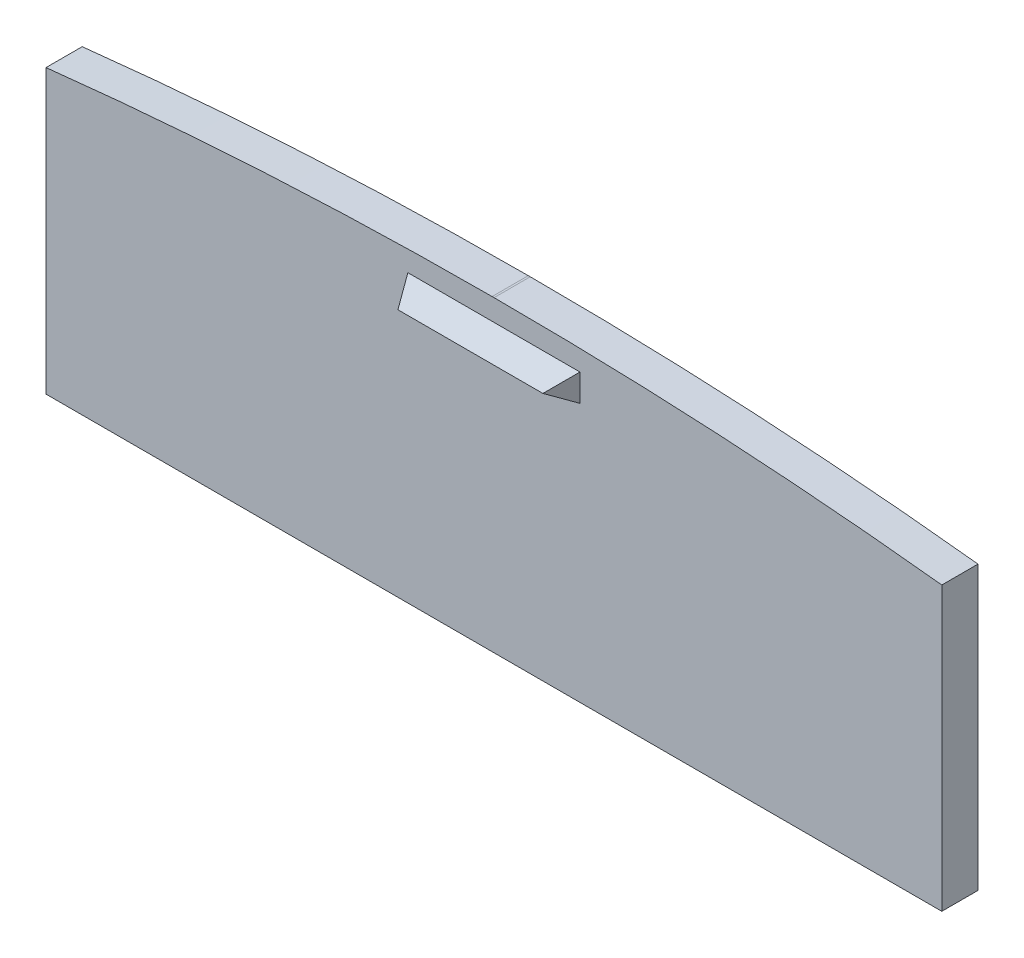
ISO-10303-21;
HEADER;
FILE_DESCRIPTION(('STEP AP214'),'2;1');
FILE_NAME('part.step','',(''),(''),'','','');
FILE_SCHEMA(('AUTOMOTIVE_DESIGN { 1 0 10303 214 1 1 1 1 }'));
ENDSEC;
DATA;
#1=APPLICATION_CONTEXT('core data for automotive mechanical design processes');
#2=APPLICATION_PROTOCOL_DEFINITION('international standard','automotive_design',2000,#1);
#3=PRODUCT_CONTEXT('',#1,'mechanical');
#4=PRODUCT('Part','Part','',(#3));
#5=PRODUCT_RELATED_PRODUCT_CATEGORY('part','',(#4));
#6=PRODUCT_DEFINITION_FORMATION('','',#4);
#7=PRODUCT_DEFINITION_CONTEXT('part definition',#1,'design');
#8=PRODUCT_DEFINITION('design','',#6,#7);
#9=PRODUCT_DEFINITION_SHAPE('','',#8);
#10=(LENGTH_UNIT() NAMED_UNIT(*) SI_UNIT(.MILLI.,.METRE.));
#11=(NAMED_UNIT(*) PLANE_ANGLE_UNIT() SI_UNIT($,.RADIAN.));
#12=(NAMED_UNIT(*) SI_UNIT($,.STERADIAN.) SOLID_ANGLE_UNIT());
#13=UNCERTAINTY_MEASURE_WITH_UNIT(LENGTH_MEASURE(1.E-05),#10,'distance_accuracy_value','');
#14=(GEOMETRIC_REPRESENTATION_CONTEXT(3) GLOBAL_UNCERTAINTY_ASSIGNED_CONTEXT((#13)) GLOBAL_UNIT_ASSIGNED_CONTEXT((#10,
#11,#12)) REPRESENTATION_CONTEXT('',''));
#15=CARTESIAN_POINT('',(0.,0.,0.));
#16=DIRECTION('',(0.,0.,1.));
#17=DIRECTION('',(1.,0.,0.));
#18=AXIS2_PLACEMENT_3D('',#15,#16,#17);
#19=CARTESIAN_POINT('',(0.,0.,4.));
#20=DIRECTION('',(0.,0.,1.));
#21=DIRECTION('',(1.,0.,0.));
#22=AXIS2_PLACEMENT_3D('',#19,#20,#21);
#23=PLANE('',#22);
#24=DIRECTION('',(0.,1.,0.));
#25=VECTOR('',#24,1.);
#26=CARTESIAN_POINT('',(114.867211543248,0.,4.));
#27=LINE('',#26,#25);
#28=CARTESIAN_POINT('',(114.867211543248,122.64910236072,4.));
#29=VERTEX_POINT('',#28);
#30=CARTESIAN_POINT('',(114.867211543248,153.891733148485,4.));
#31=VERTEX_POINT('',#30);
#32=EDGE_CURVE('E159',#29,#31,#27,.T.);
#33=ORIENTED_EDGE('',*,*,#32,.T.);
#34=CARTESIAN_POINT('',(65.2642908848253,-290.886393144842,4.));
#35=DIRECTION('',(0.,0.,1.));
#36=DIRECTION('',(1.,0.,0.));
#37=AXIS2_PLACEMENT_3D('',#34,#35,#36);
#38=CIRCLE('',#37,447.535508498318);
#39=CARTESIAN_POINT('',(65.3721307666193,156.64910236072,4.));
#40=VERTEX_POINT('',#39);
#41=EDGE_CURVE('E101',#31,#40,#38,.T.);
#42=ORIENTED_EDGE('',*,*,#41,.T.);
#43=DIRECTION('',(1.,0.,0.));
#44=VECTOR('',#43,1.);
#45=CARTESIAN_POINT('',(0.,156.64910236072,4.));
#46=LINE('',#45,#44);
#47=CARTESIAN_POINT('',(65.1564510030312,156.64910236072,4.));
#48=VERTEX_POINT('',#47);
#49=EDGE_CURVE('E117',#48,#40,#46,.T.);
#50=ORIENTED_EDGE('',*,*,#49,.F.);
#51=CARTESIAN_POINT('',(15.843049481254,153.911956970105,4.));
#52=VERTEX_POINT('',#51);
#53=EDGE_CURVE('E111',#48,#52,#38,.T.);
#54=ORIENTED_EDGE('',*,*,#53,.T.);
#55=DIRECTION('',(0.,1.,0.));
#56=VECTOR('',#55,1.);
#57=CARTESIAN_POINT('',(15.843049481254,0.,4.));
#58=LINE('',#57,#56);
#59=CARTESIAN_POINT('',(15.843049481254,122.64910236072,4.));
#60=VERTEX_POINT('',#59);
#61=EDGE_CURVE('E115',#60,#52,#58,.T.);
#62=ORIENTED_EDGE('',*,*,#61,.F.);
#63=DIRECTION('',(1.,0.,0.));
#64=VECTOR('',#63,1.);
#65=CARTESIAN_POINT('',(0.,122.64910236072,4.));
#66=LINE('',#65,#64);
#67=EDGE_CURVE('E66',#60,#29,#66,.T.);
#68=ORIENTED_EDGE('',*,*,#67,.T.);
#69=EDGE_LOOP('',(#33,#42,#50,#54,#62,#68));
#70=FACE_BOUND('',#69,.T.);
#71=DIRECTION('',(1.,0.,0.));
#72=VECTOR('',#71,1.);
#73=CARTESIAN_POINT('',(55.843049481254,151.277782290087,4.));
#74=LINE('',#73,#72);
#75=CARTESIAN_POINT('',(55.843049481254,151.277782290087,4.));
#76=VERTEX_POINT('',#75);
#77=CARTESIAN_POINT('',(74.8672115432476,151.277782290087,4.));
#78=VERTEX_POINT('',#77);
#79=EDGE_CURVE('E198',#76,#78,#74,.T.);
#80=ORIENTED_EDGE('',*,*,#79,.F.);
#81=DIRECTION('',(0.,-1.,0.));
#82=VECTOR('',#81,1.);
#83=CARTESIAN_POINT('',(55.843049481254,154.277782290087,4.));
#84=LINE('',#83,#82);
#85=CARTESIAN_POINT('',(55.843049481254,154.277782290087,4.));
#86=VERTEX_POINT('',#85);
#87=EDGE_CURVE('E202',#86,#76,#84,.T.);
#88=ORIENTED_EDGE('',*,*,#87,.F.);
#89=DIRECTION('',(-1.,0.,0.));
#90=VECTOR('',#89,1.);
#91=CARTESIAN_POINT('',(55.843049481254,154.277782290087,4.));
#92=LINE('',#91,#90);
#93=CARTESIAN_POINT('',(74.8672115432476,154.277782290088,4.));
#94=VERTEX_POINT('',#93);
#95=EDGE_CURVE('E192',#94,#86,#92,.T.);
#96=ORIENTED_EDGE('',*,*,#95,.F.);
#97=DIRECTION('',(0.,1.,0.));
#98=VECTOR('',#97,1.);
#99=CARTESIAN_POINT('',(74.8672115432476,154.277782290087,4.));
#100=LINE('',#99,#98);
#101=EDGE_CURVE('E195',#78,#94,#100,.T.);
#102=ORIENTED_EDGE('',*,*,#101,.F.);
#103=EDGE_LOOP('',(#80,#88,#96,#102));
#104=FACE_BOUND('',#103,.T.);
#105=ADVANCED_FACE('F41',(#70,#104),#23,.T.);
#106=CARTESIAN_POINT('',(114.867211543248,0.,4.));
#107=DIRECTION('',(-1.,0.,0.));
#108=DIRECTION('',(0.,-1.,0.));
#109=AXIS2_PLACEMENT_3D('',#106,#107,#108);
#110=PLANE('',#109);
#111=DIRECTION('',(0.,1.,0.));
#112=VECTOR('',#111,1.);
#113=CARTESIAN_POINT('',(114.867211543248,0.,0.));
#114=LINE('',#113,#112);
#115=CARTESIAN_POINT('',(114.867211543248,122.64910236072,0.));
#116=VERTEX_POINT('',#115);
#117=CARTESIAN_POINT('',(114.867211543248,153.891733148485,0.));
#118=VERTEX_POINT('',#117);
#119=EDGE_CURVE('E141',#116,#118,#114,.T.);
#120=ORIENTED_EDGE('',*,*,#119,.T.);
#121=DIRECTION('',(0.,0.,-1.));
#122=VECTOR('',#121,1.);
#123=CARTESIAN_POINT('',(114.867211543248,153.891733148485,4.));
#124=LINE('',#123,#122);
#125=EDGE_CURVE('E11',#31,#118,#124,.T.);
#126=ORIENTED_EDGE('',*,*,#125,.F.);
#127=ORIENTED_EDGE('',*,*,#32,.F.);
#128=DIRECTION('',(0.,0.,-1.));
#129=VECTOR('',#128,1.);
#130=CARTESIAN_POINT('',(114.867211543248,122.64910236072,4.));
#131=LINE('',#130,#129);
#132=EDGE_CURVE('E137',#29,#116,#131,.T.);
#133=ORIENTED_EDGE('',*,*,#132,.T.);
#134=EDGE_LOOP('',(#120,#126,#127,#133));
#135=FACE_BOUND('',#134,.T.);
#136=ADVANCED_FACE('F43',(#135),#110,.F.);
#137=CARTESIAN_POINT('',(65.2642908848253,-290.886393144842,4.));
#138=DIRECTION('',(0.,0.,-1.));
#139=DIRECTION('',(-1.,0.,0.));
#140=AXIS2_PLACEMENT_3D('',#137,#138,#139);
#141=CYLINDRICAL_SURFACE('',#140,447.535508498318);
#142=CARTESIAN_POINT('',(65.2642908848253,-290.886393144842,0.));
#143=DIRECTION('',(0.,0.,1.));
#144=DIRECTION('',(1.,0.,0.));
#145=AXIS2_PLACEMENT_3D('',#142,#143,#144);
#146=CIRCLE('',#145,447.535508498318);
#147=CARTESIAN_POINT('',(65.3721307666193,156.64910236072,0.));
#148=VERTEX_POINT('',#147);
#149=EDGE_CURVE('E145',#118,#148,#146,.T.);
#150=ORIENTED_EDGE('',*,*,#149,.T.);
#151=DIRECTION('',(0.,0.,-1.));
#152=VECTOR('',#151,1.);
#153=CARTESIAN_POINT('',(65.3721307666193,156.64910236072,4.));
#154=LINE('',#153,#152);
#155=EDGE_CURVE('E50',#40,#148,#154,.T.);
#156=ORIENTED_EDGE('',*,*,#155,.F.);
#157=ORIENTED_EDGE('',*,*,#41,.F.);
#158=ORIENTED_EDGE('',*,*,#125,.T.);
#159=EDGE_LOOP('',(#150,#156,#157,#158));
#160=FACE_BOUND('',#159,.T.);
#161=ADVANCED_FACE('F169',(#160),#141,.T.);
#162=CARTESIAN_POINT('',(0.,156.64910236072,4.));
#163=DIRECTION('',(0.,1.,0.));
#164=DIRECTION('',(0.,0.,1.));
#165=AXIS2_PLACEMENT_3D('',#162,#163,#164);
#166=PLANE('',#165);
#167=DIRECTION('',(1.,0.,0.));
#168=VECTOR('',#167,1.);
#169=CARTESIAN_POINT('',(0.,156.64910236072,0.));
#170=LINE('',#169,#168);
#171=CARTESIAN_POINT('',(65.1564510030312,156.64910236072,0.));
#172=VERTEX_POINT('',#171);
#173=EDGE_CURVE('E150',#172,#148,#170,.T.);
#174=ORIENTED_EDGE('',*,*,#173,.F.);
#175=DIRECTION('',(0.,0.,-1.));
#176=VECTOR('',#175,1.);
#177=CARTESIAN_POINT('',(65.1564510030312,156.64910236072,4.));
#178=LINE('',#177,#176);
#179=EDGE_CURVE('E130',#48,#172,#178,.T.);
#180=ORIENTED_EDGE('',*,*,#179,.F.);
#181=ORIENTED_EDGE('',*,*,#49,.T.);
#182=ORIENTED_EDGE('',*,*,#155,.T.);
#183=EDGE_LOOP('',(#174,#180,#181,#182));
#184=FACE_BOUND('',#183,.T.);
#185=ADVANCED_FACE('F168',(#184),#166,.T.);
#186=CARTESIAN_POINT('',(15.843049481254,153.911956970105,0.));
#187=VERTEX_POINT('',#186);
#188=EDGE_CURVE('E125',#172,#187,#146,.T.);
#189=ORIENTED_EDGE('',*,*,#188,.T.);
#190=DIRECTION('',(0.,0.,-1.));
#191=VECTOR('',#190,1.);
#192=CARTESIAN_POINT('',(15.843049481254,153.911956970105,4.));
#193=LINE('',#192,#191);
#194=EDGE_CURVE('E122',#52,#187,#193,.T.);
#195=ORIENTED_EDGE('',*,*,#194,.F.);
#196=ORIENTED_EDGE('',*,*,#53,.F.);
#197=ORIENTED_EDGE('',*,*,#179,.T.);
#198=EDGE_LOOP('',(#189,#195,#196,#197));
#199=FACE_BOUND('',#198,.T.);
#200=ADVANCED_FACE('F123',(#199),#141,.T.);
#201=CARTESIAN_POINT('',(15.843049481254,0.,4.));
#202=DIRECTION('',(-1.,0.,0.));
#203=DIRECTION('',(0.,0.,1.));
#204=AXIS2_PLACEMENT_3D('',#201,#202,#203);
#205=PLANE('',#204);
#206=DIRECTION('',(0.,1.,0.));
#207=VECTOR('',#206,1.);
#208=CARTESIAN_POINT('',(15.843049481254,0.,0.));
#209=LINE('',#208,#207);
#210=CARTESIAN_POINT('',(15.843049481254,122.64910236072,0.));
#211=VERTEX_POINT('',#210);
#212=EDGE_CURVE('E154',#211,#187,#209,.T.);
#213=ORIENTED_EDGE('',*,*,#212,.F.);
#214=DIRECTION('',(0.,0.,-1.));
#215=VECTOR('',#214,1.);
#216=CARTESIAN_POINT('',(15.843049481254,122.64910236072,4.));
#217=LINE('',#216,#215);
#218=EDGE_CURVE('E131',#60,#211,#217,.T.);
#219=ORIENTED_EDGE('',*,*,#218,.F.);
#220=ORIENTED_EDGE('',*,*,#61,.T.);
#221=ORIENTED_EDGE('',*,*,#194,.T.);
#222=EDGE_LOOP('',(#213,#219,#220,#221));
#223=FACE_BOUND('',#222,.T.);
#224=ADVANCED_FACE('F133',(#223),#205,.T.);
#225=CARTESIAN_POINT('',(0.,122.64910236072,4.));
#226=DIRECTION('',(0.,1.,0.));
#227=DIRECTION('',(0.,0.,1.));
#228=AXIS2_PLACEMENT_3D('',#225,#226,#227);
#229=PLANE('',#228);
#230=DIRECTION('',(1.,0.,0.));
#231=VECTOR('',#230,1.);
#232=CARTESIAN_POINT('',(0.,122.64910236072,0.));
#233=LINE('',#232,#231);
#234=EDGE_CURVE('E93',#211,#116,#233,.T.);
#235=ORIENTED_EDGE('',*,*,#234,.T.);
#236=ORIENTED_EDGE('',*,*,#132,.F.);
#237=ORIENTED_EDGE('',*,*,#67,.F.);
#238=ORIENTED_EDGE('',*,*,#218,.T.);
#239=EDGE_LOOP('',(#235,#236,#237,#238));
#240=FACE_BOUND('',#239,.T.);
#241=ADVANCED_FACE('F217',(#240),#229,.F.);
#242=CARTESIAN_POINT('',(0.,0.,0.));
#243=DIRECTION('',(0.,0.,1.));
#244=DIRECTION('',(1.,0.,0.));
#245=AXIS2_PLACEMENT_3D('',#242,#243,#244);
#246=PLANE('',#245);
#247=ORIENTED_EDGE('',*,*,#119,.F.);
#248=ORIENTED_EDGE('',*,*,#234,.F.);
#249=ORIENTED_EDGE('',*,*,#212,.T.);
#250=ORIENTED_EDGE('',*,*,#188,.F.);
#251=ORIENTED_EDGE('',*,*,#173,.T.);
#252=ORIENTED_EDGE('',*,*,#149,.F.);
#253=EDGE_LOOP('',(#247,#248,#249,#250,#251,#252));
#254=FACE_BOUND('',#253,.T.);
#255=ADVANCED_FACE('F173',(#254),#246,.F.);
#256=CARTESIAN_POINT('',(55.843049481254,154.277782290087,4.));
#257=DIRECTION('',(-0.866025403784438,0.,0.5));
#258=DIRECTION('',(0.5,0.,0.866025403784438));
#259=AXIS2_PLACEMENT_3D('',#256,#257,#258);
#260=PLANE('',#259);
#261=ORIENTED_EDGE('',*,*,#87,.T.);
#262=DIRECTION('',(-0.447213595499958,-0.447213595499958,-0.774596669241483));
#263=VECTOR('',#262,1.);
#264=CARTESIAN_POINT('',(55.843049481254,151.277782290087,4.));
#265=LINE('',#264,#263);
#266=CARTESIAN_POINT('',(57.343049481254,152.777782290087,6.59807621135332));
#267=VERTEX_POINT('',#266);
#268=EDGE_CURVE('E178',#267,#76,#265,.T.);
#269=ORIENTED_EDGE('',*,*,#268,.F.);
#270=DIRECTION('',(-0.447213595499958,0.447213595499958,-0.774596669241483));
#271=VECTOR('',#270,1.);
#272=CARTESIAN_POINT('',(55.843049481254,154.277782290087,4.));
#273=LINE('',#272,#271);
#274=EDGE_CURVE('E188',#267,#86,#273,.T.);
#275=ORIENTED_EDGE('',*,*,#274,.T.);
#276=EDGE_LOOP('',(#261,#269,#275));
#277=FACE_BOUND('',#276,.T.);
#278=ADVANCED_FACE('F224',(#277),#260,.T.);
#279=CARTESIAN_POINT('',(55.843049481254,151.277782290087,4.));
#280=DIRECTION('',(0.,-0.866025403784438,0.5));
#281=DIRECTION('',(0.,-0.5,-0.866025403784439));
#282=AXIS2_PLACEMENT_3D('',#279,#280,#281);
#283=PLANE('',#282);
#284=DIRECTION('',(0.447213595499958,-0.447213595499958,-0.774596669241483));
#285=VECTOR('',#284,1.);
#286=CARTESIAN_POINT('',(74.2672115432476,151.877782290087,5.03923048454133));
#287=LINE('',#286,#285);
#288=CARTESIAN_POINT('',(73.3672115432476,152.777782290087,6.59807621135332));
#289=VERTEX_POINT('',#288);
#290=EDGE_CURVE('E182',#289,#78,#287,.T.);
#291=ORIENTED_EDGE('',*,*,#290,.F.);
#292=DIRECTION('',(-1.,0.,0.));
#293=VECTOR('',#292,1.);
#294=CARTESIAN_POINT('',(55.843049481254,152.777782290087,6.59807621135332));
#295=LINE('',#294,#293);
#296=EDGE_CURVE('E146',#289,#267,#295,.T.);
#297=ORIENTED_EDGE('',*,*,#296,.T.);
#298=ORIENTED_EDGE('',*,*,#268,.T.);
#299=ORIENTED_EDGE('',*,*,#79,.T.);
#300=EDGE_LOOP('',(#291,#297,#298,#299));
#301=FACE_BOUND('',#300,.T.);
#302=ADVANCED_FACE('F233',(#301),#283,.T.);
#303=CARTESIAN_POINT('',(74.8672115432476,154.277782290087,4.));
#304=DIRECTION('',(0.866025403784438,0.,0.5));
#305=DIRECTION('',(0.5,0.,-0.866025403784438));
#306=AXIS2_PLACEMENT_3D('',#303,#304,#305);
#307=PLANE('',#306);
#308=ORIENTED_EDGE('',*,*,#101,.T.);
#309=DIRECTION('',(0.447213595499958,0.447213595499958,-0.774596669241483));
#310=VECTOR('',#309,1.);
#311=CARTESIAN_POINT('',(71.0623791308489,150.472949877689,10.5901630525594));
#312=LINE('',#311,#310);
#313=EDGE_CURVE('E57',#289,#94,#312,.T.);
#314=ORIENTED_EDGE('',*,*,#313,.F.);
#315=ORIENTED_EDGE('',*,*,#290,.T.);
#316=EDGE_LOOP('',(#308,#314,#315));
#317=FACE_BOUND('',#316,.T.);
#318=ADVANCED_FACE('F236',(#317),#307,.T.);
#319=CARTESIAN_POINT('',(55.843049481254,154.277782290087,4.));
#320=DIRECTION('',(0.,0.866025403784438,0.5));
#321=DIRECTION('',(0.,-0.5,0.866025403784439));
#322=AXIS2_PLACEMENT_3D('',#319,#320,#321);
#323=PLANE('',#322);
#324=ORIENTED_EDGE('',*,*,#296,.F.);
#325=ORIENTED_EDGE('',*,*,#313,.T.);
#326=ORIENTED_EDGE('',*,*,#95,.T.);
#327=ORIENTED_EDGE('',*,*,#274,.F.);
#328=EDGE_LOOP('',(#324,#325,#326,#327));
#329=FACE_BOUND('',#328,.T.);
#330=ADVANCED_FACE('F240',(#329),#323,.T.);
#331=CLOSED_SHELL('',(#105,#136,#161,#185,#200,#224,#241,#255,#278,#302,#318,#330));
#332=MANIFOLD_SOLID_BREP('B2',#331);
#333=ADVANCED_BREP_SHAPE_REPRESENTATION('',(#18,#332),#14);
#334=SHAPE_DEFINITION_REPRESENTATION(#9,#333);
ENDSEC;
END-ISO-10303-21;
